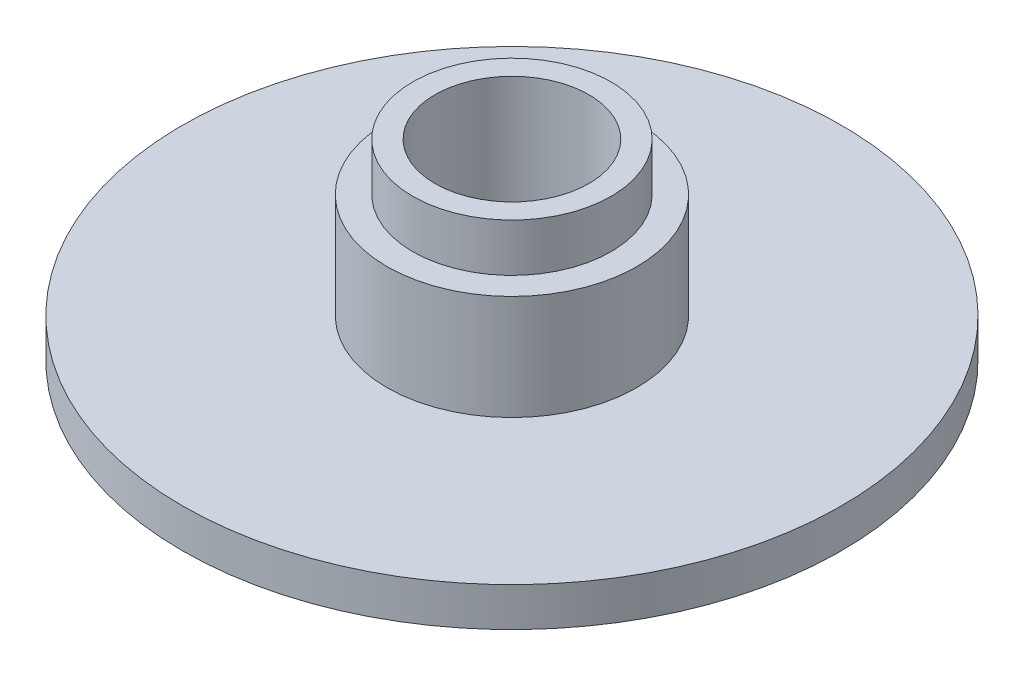
ISO-10303-21;
HEADER;
FILE_DESCRIPTION(('STEP AP214'),'2;1');
FILE_NAME('part.step','',(''),(''),'','','');
FILE_SCHEMA(('AUTOMOTIVE_DESIGN { 1 0 10303 214 1 1 1 1 }'));
ENDSEC;
DATA;
#1=APPLICATION_CONTEXT('core data for automotive mechanical design processes');
#2=APPLICATION_PROTOCOL_DEFINITION('international standard','automotive_design',2000,#1);
#3=PRODUCT_CONTEXT('',#1,'mechanical');
#4=PRODUCT('Part','Part','',(#3));
#5=PRODUCT_RELATED_PRODUCT_CATEGORY('part','',(#4));
#6=PRODUCT_DEFINITION_FORMATION('','',#4);
#7=PRODUCT_DEFINITION_CONTEXT('part definition',#1,'design');
#8=PRODUCT_DEFINITION('design','',#6,#7);
#9=PRODUCT_DEFINITION_SHAPE('','',#8);
#10=(LENGTH_UNIT() NAMED_UNIT(*) SI_UNIT(.MILLI.,.METRE.));
#11=(NAMED_UNIT(*) PLANE_ANGLE_UNIT() SI_UNIT($,.RADIAN.));
#12=(NAMED_UNIT(*) SI_UNIT($,.STERADIAN.) SOLID_ANGLE_UNIT());
#13=UNCERTAINTY_MEASURE_WITH_UNIT(LENGTH_MEASURE(1.E-05),#10,'distance_accuracy_value','');
#14=(GEOMETRIC_REPRESENTATION_CONTEXT(3) GLOBAL_UNCERTAINTY_ASSIGNED_CONTEXT((#13)) GLOBAL_UNIT_ASSIGNED_CONTEXT((#10,
#11,#12)) REPRESENTATION_CONTEXT('',''));
#15=CARTESIAN_POINT('',(0.,0.,0.));
#16=DIRECTION('',(0.,0.,1.));
#17=DIRECTION('',(1.,0.,0.));
#18=AXIS2_PLACEMENT_3D('',#15,#16,#17);
#19=CARTESIAN_POINT('',(0.,3.25,0.));
#20=DIRECTION('',(0.,-1.,0.));
#21=DIRECTION('',(0.,0.,-1.));
#22=AXIS2_PLACEMENT_3D('',#19,#20,#21);
#23=CYLINDRICAL_SURFACE('',#22,27.5);
#24=CARTESIAN_POINT('',(0.,3.25,0.));
#25=DIRECTION('',(0.,1.,0.));
#26=DIRECTION('',(0.,0.,1.));
#27=AXIS2_PLACEMENT_3D('',#24,#25,#26);
#28=CIRCLE('',#27,27.5);
#29=CARTESIAN_POINT('',(0.,3.25,27.5));
#30=VERTEX_POINT('',#29);
#31=EDGE_CURVE('E11',#30,#30,#28,.T.);
#32=ORIENTED_EDGE('',*,*,#31,.F.);
#33=EDGE_LOOP('',(#32));
#34=FACE_BOUND('',#33,.T.);
#35=CARTESIAN_POINT('',(0.,0.,0.));
#36=DIRECTION('',(0.,1.,0.));
#37=DIRECTION('',(0.,0.,1.));
#38=AXIS2_PLACEMENT_3D('',#35,#36,#37);
#39=CIRCLE('',#38,27.5);
#40=CARTESIAN_POINT('',(0.,0.,27.5));
#41=VERTEX_POINT('',#40);
#42=EDGE_CURVE('E47',#41,#41,#39,.T.);
#43=ORIENTED_EDGE('',*,*,#42,.T.);
#44=EDGE_LOOP('',(#43));
#45=FACE_BOUND('',#44,.T.);
#46=ADVANCED_FACE('F36',(#34,#45),#23,.T.);
#47=CARTESIAN_POINT('',(0.,3.25,0.));
#48=DIRECTION('',(0.,-1.,0.));
#49=DIRECTION('',(0.,0.,-1.));
#50=AXIS2_PLACEMENT_3D('',#47,#48,#49);
#51=CYLINDRICAL_SURFACE('',#50,6.425);
#52=CARTESIAN_POINT('',(0.,0.,0.));
#53=DIRECTION('',(0.,1.,0.));
#54=DIRECTION('',(0.,0.,1.));
#55=AXIS2_PLACEMENT_3D('',#52,#53,#54);
#56=CIRCLE('',#55,6.425);
#57=CARTESIAN_POINT('',(0.,0.,6.425));
#58=VERTEX_POINT('',#57);
#59=EDGE_CURVE('E39',#58,#58,#56,.T.);
#60=ORIENTED_EDGE('',*,*,#59,.F.);
#61=EDGE_LOOP('',(#60));
#62=FACE_BOUND('',#61,.T.);
#63=CARTESIAN_POINT('',(0.,16.,0.));
#64=DIRECTION('',(0.,1.,0.));
#65=DIRECTION('',(0.,0.,1.));
#66=AXIS2_PLACEMENT_3D('',#63,#64,#65);
#67=CIRCLE('',#66,6.425);
#68=CARTESIAN_POINT('',(0.,16.,6.425));
#69=VERTEX_POINT('',#68);
#70=EDGE_CURVE('E49',#69,#69,#67,.T.);
#71=ORIENTED_EDGE('',*,*,#70,.T.);
#72=EDGE_LOOP('',(#71));
#73=FACE_BOUND('',#72,.T.);
#74=ADVANCED_FACE('F88',(#62,#73),#51,.F.);
#75=CARTESIAN_POINT('',(0.,3.25,0.));
#76=DIRECTION('',(0.,1.,0.));
#77=DIRECTION('',(0.,0.,1.));
#78=AXIS2_PLACEMENT_3D('',#75,#76,#77);
#79=PLANE('',#78);
#80=CARTESIAN_POINT('',(0.,3.25,0.));
#81=DIRECTION('',(0.,1.,0.));
#82=DIRECTION('',(0.,0.,1.));
#83=AXIS2_PLACEMENT_3D('',#80,#81,#82);
#84=CIRCLE('',#83,10.425);
#85=CARTESIAN_POINT('',(0.,3.25,10.425));
#86=VERTEX_POINT('',#85);
#87=EDGE_CURVE('E59',#86,#86,#84,.F.);
#88=ORIENTED_EDGE('',*,*,#87,.T.);
#89=EDGE_LOOP('',(#88));
#90=FACE_BOUND('',#89,.T.);
#91=ORIENTED_EDGE('',*,*,#31,.T.);
#92=EDGE_LOOP('',(#91));
#93=FACE_BOUND('',#92,.T.);
#94=ADVANCED_FACE('F93',(#90,#93),#79,.T.);
#95=CARTESIAN_POINT('',(0.,0.,0.));
#96=DIRECTION('',(0.,1.,0.));
#97=DIRECTION('',(0.,0.,1.));
#98=AXIS2_PLACEMENT_3D('',#95,#96,#97);
#99=PLANE('',#98);
#100=ORIENTED_EDGE('',*,*,#42,.F.);
#101=EDGE_LOOP('',(#100));
#102=FACE_BOUND('',#101,.T.);
#103=ORIENTED_EDGE('',*,*,#59,.T.);
#104=EDGE_LOOP('',(#103));
#105=FACE_BOUND('',#104,.T.);
#106=ADVANCED_FACE('F98',(#102,#105),#99,.F.);
#107=CARTESIAN_POINT('',(0.,52.1552344572747,0.));
#108=DIRECTION('',(0.,-1.,0.));
#109=DIRECTION('',(0.,0.,-1.));
#110=AXIS2_PLACEMENT_3D('',#107,#108,#109);
#111=CYLINDRICAL_SURFACE('',#110,8.275);
#112=CARTESIAN_POINT('',(0.,12.,0.));
#113=DIRECTION('',(0.,1.,0.));
#114=DIRECTION('',(0.,0.,1.));
#115=AXIS2_PLACEMENT_3D('',#112,#113,#114);
#116=CIRCLE('',#115,8.275);
#117=CARTESIAN_POINT('',(0.,12.,8.275));
#118=VERTEX_POINT('',#117);
#119=EDGE_CURVE('E64',#118,#118,#116,.T.);
#120=ORIENTED_EDGE('',*,*,#119,.T.);
#121=EDGE_LOOP('',(#120));
#122=FACE_BOUND('',#121,.T.);
#123=CARTESIAN_POINT('',(0.,16.,0.));
#124=DIRECTION('',(0.,1.,0.));
#125=DIRECTION('',(0.,0.,1.));
#126=AXIS2_PLACEMENT_3D('',#123,#124,#125);
#127=CIRCLE('',#126,8.275);
#128=CARTESIAN_POINT('',(0.,16.,8.275));
#129=VERTEX_POINT('',#128);
#130=EDGE_CURVE('E52',#129,#129,#127,.T.);
#131=ORIENTED_EDGE('',*,*,#130,.F.);
#132=EDGE_LOOP('',(#131));
#133=FACE_BOUND('',#132,.T.);
#134=ADVANCED_FACE('F83',(#122,#133),#111,.T.);
#135=CARTESIAN_POINT('',(0.,16.,0.));
#136=DIRECTION('',(0.,1.,0.));
#137=DIRECTION('',(0.,0.,1.));
#138=AXIS2_PLACEMENT_3D('',#135,#136,#137);
#139=PLANE('',#138);
#140=ORIENTED_EDGE('',*,*,#70,.F.);
#141=EDGE_LOOP('',(#140));
#142=FACE_BOUND('',#141,.T.);
#143=ORIENTED_EDGE('',*,*,#130,.T.);
#144=EDGE_LOOP('',(#143));
#145=FACE_BOUND('',#144,.T.);
#146=ADVANCED_FACE('F74',(#142,#145),#139,.T.);
#147=CARTESIAN_POINT('',(0.,50.236352775479,0.));
#148=DIRECTION('',(0.,-1.,0.));
#149=DIRECTION('',(0.,0.,-1.));
#150=AXIS2_PLACEMENT_3D('',#147,#148,#149);
#151=CYLINDRICAL_SURFACE('',#150,10.425);
#152=ORIENTED_EDGE('',*,*,#87,.F.);
#153=EDGE_LOOP('',(#152));
#154=FACE_BOUND('',#153,.T.);
#155=CARTESIAN_POINT('',(0.,12.,0.));
#156=DIRECTION('',(0.,1.,0.));
#157=DIRECTION('',(0.,0.,1.));
#158=AXIS2_PLACEMENT_3D('',#155,#156,#157);
#159=CIRCLE('',#158,10.425);
#160=CARTESIAN_POINT('',(0.,12.,10.425));
#161=VERTEX_POINT('',#160);
#162=EDGE_CURVE('E63',#161,#161,#159,.T.);
#163=ORIENTED_EDGE('',*,*,#162,.F.);
#164=EDGE_LOOP('',(#163));
#165=FACE_BOUND('',#164,.T.);
#166=ADVANCED_FACE('F72',(#154,#165),#151,.T.);
#167=CARTESIAN_POINT('',(0.,12.,0.));
#168=DIRECTION('',(0.,1.,0.));
#169=DIRECTION('',(0.,0.,1.));
#170=AXIS2_PLACEMENT_3D('',#167,#168,#169);
#171=PLANE('',#170);
#172=ORIENTED_EDGE('',*,*,#119,.F.);
#173=EDGE_LOOP('',(#172));
#174=FACE_BOUND('',#173,.T.);
#175=ORIENTED_EDGE('',*,*,#162,.T.);
#176=EDGE_LOOP('',(#175));
#177=FACE_BOUND('',#176,.T.);
#178=ADVANCED_FACE('F70',(#174,#177),#171,.T.);
#179=CLOSED_SHELL('',(#46,#74,#94,#106,#134,#146,#166,#178));
#180=MANIFOLD_SOLID_BREP('B2',#179);
#181=ADVANCED_BREP_SHAPE_REPRESENTATION('',(#18,#180),#14);
#182=SHAPE_DEFINITION_REPRESENTATION(#9,#181);
ENDSEC;
END-ISO-10303-21;
